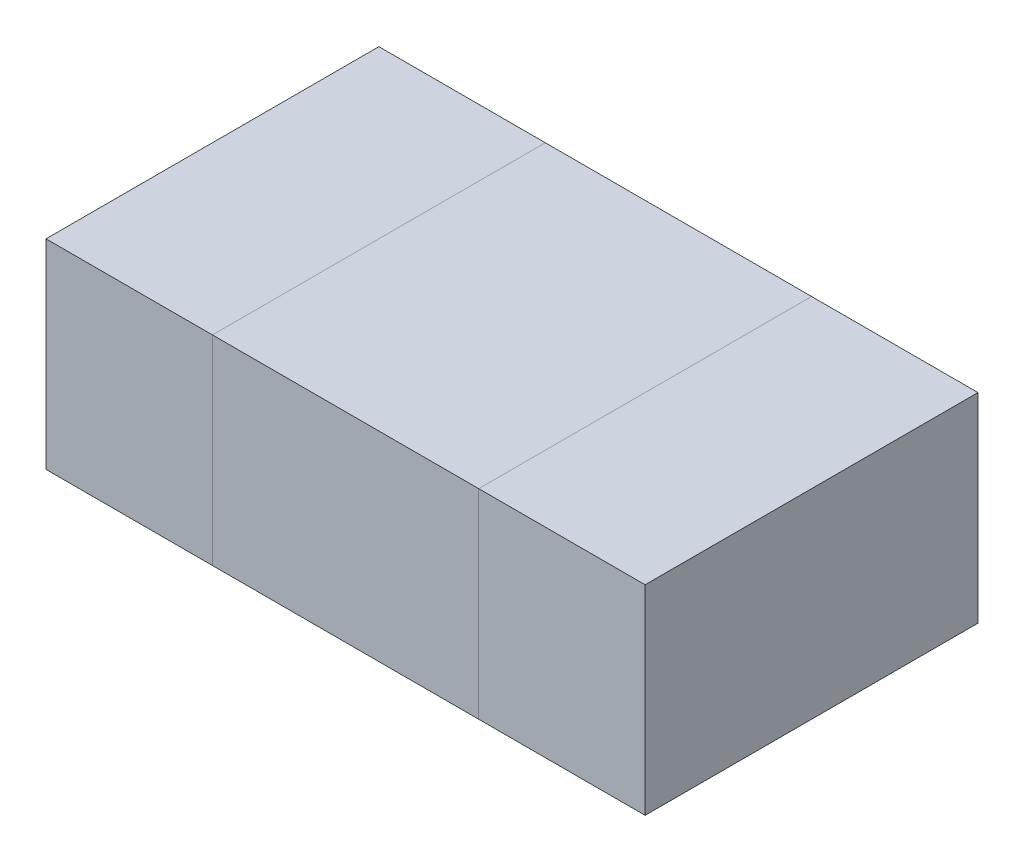
ISO-10303-21;
HEADER;
FILE_DESCRIPTION(('STEP AP214'),'2;1');
FILE_NAME('part.step','',(''),(''),'','','');
FILE_SCHEMA(('AUTOMOTIVE_DESIGN { 1 0 10303 214 1 1 1 1 }'));
ENDSEC;
DATA;
#1=APPLICATION_CONTEXT('core data for automotive mechanical design processes');
#2=APPLICATION_PROTOCOL_DEFINITION('international standard','automotive_design',2000,#1);
#3=PRODUCT_CONTEXT('',#1,'mechanical');
#4=PRODUCT('Part','Part','',(#3));
#5=PRODUCT_RELATED_PRODUCT_CATEGORY('part','',(#4));
#6=PRODUCT_DEFINITION_FORMATION('','',#4);
#7=PRODUCT_DEFINITION_CONTEXT('part definition',#1,'design');
#8=PRODUCT_DEFINITION('design','',#6,#7);
#9=PRODUCT_DEFINITION_SHAPE('','',#8);
#10=(LENGTH_UNIT() NAMED_UNIT(*) SI_UNIT(.MILLI.,.METRE.));
#11=(NAMED_UNIT(*) PLANE_ANGLE_UNIT() SI_UNIT($,.RADIAN.));
#12=(NAMED_UNIT(*) SI_UNIT($,.STERADIAN.) SOLID_ANGLE_UNIT());
#13=UNCERTAINTY_MEASURE_WITH_UNIT(LENGTH_MEASURE(1.E-05),#10,'distance_accuracy_value','');
#14=(GEOMETRIC_REPRESENTATION_CONTEXT(3) GLOBAL_UNCERTAINTY_ASSIGNED_CONTEXT((#13)) GLOBAL_UNIT_ASSIGNED_CONTEXT((#10,
#11,#12)) REPRESENTATION_CONTEXT('',''));
#15=CARTESIAN_POINT('',(0.,0.,0.));
#16=DIRECTION('',(0.,0.,1.));
#17=DIRECTION('',(1.,0.,0.));
#18=AXIS2_PLACEMENT_3D('',#15,#16,#17);
#19=CARTESIAN_POINT('',(0.2,0.3,-0.25));
#20=DIRECTION('',(1.,0.,0.));
#21=DIRECTION('',(0.,0.,-1.));
#22=AXIS2_PLACEMENT_3D('',#19,#20,#21);
#23=PLANE('',#22);
#24=DIRECTION('',(0.,0.,1.));
#25=VECTOR('',#24,1.);
#26=CARTESIAN_POINT('',(0.2,0.,-0.25));
#27=LINE('',#26,#25);
#28=CARTESIAN_POINT('',(0.2,0.,-0.25));
#29=VERTEX_POINT('',#28);
#30=CARTESIAN_POINT('',(0.2,0.,0.25));
#31=VERTEX_POINT('',#30);
#32=EDGE_CURVE('E117',#29,#31,#27,.T.);
#33=ORIENTED_EDGE('',*,*,#32,.T.);
#34=DIRECTION('',(0.,-1.,0.));
#35=VECTOR('',#34,1.);
#36=CARTESIAN_POINT('',(0.2,0.3,0.25));
#37=LINE('',#36,#35);
#38=CARTESIAN_POINT('',(0.2,0.3,0.25));
#39=VERTEX_POINT('',#38);
#40=EDGE_CURVE('E12',#39,#31,#37,.T.);
#41=ORIENTED_EDGE('',*,*,#40,.F.);
#42=DIRECTION('',(0.,0.,1.));
#43=VECTOR('',#42,1.);
#44=CARTESIAN_POINT('',(0.2,0.3,-0.25));
#45=LINE('',#44,#43);
#46=CARTESIAN_POINT('',(0.2,0.3,-0.25));
#47=VERTEX_POINT('',#46);
#48=EDGE_CURVE('E100',#47,#39,#45,.T.);
#49=ORIENTED_EDGE('',*,*,#48,.F.);
#50=DIRECTION('',(0.,-1.,0.));
#51=VECTOR('',#50,1.);
#52=CARTESIAN_POINT('',(0.2,0.3,-0.25));
#53=LINE('',#52,#51);
#54=EDGE_CURVE('E113',#47,#29,#53,.T.);
#55=ORIENTED_EDGE('',*,*,#54,.T.);
#56=EDGE_LOOP('',(#33,#41,#49,#55));
#57=FACE_BOUND('',#56,.T.);
#58=ADVANCED_FACE('F48',(#57),#23,.F.);
#59=CARTESIAN_POINT('',(0.2,0.3,0.25));
#60=DIRECTION('',(0.,0.,-1.));
#61=DIRECTION('',(-1.,0.,0.));
#62=AXIS2_PLACEMENT_3D('',#59,#60,#61);
#63=PLANE('',#62);
#64=DIRECTION('',(1.,0.,0.));
#65=VECTOR('',#64,1.);
#66=CARTESIAN_POINT('',(0.2,0.,0.25));
#67=LINE('',#66,#65);
#68=CARTESIAN_POINT('',(0.45,0.,0.25));
#69=VERTEX_POINT('',#68);
#70=EDGE_CURVE('E105',#31,#69,#67,.T.);
#71=ORIENTED_EDGE('',*,*,#70,.T.);
#72=DIRECTION('',(0.,-1.,0.));
#73=VECTOR('',#72,1.);
#74=CARTESIAN_POINT('',(0.45,0.3,0.25));
#75=LINE('',#74,#73);
#76=CARTESIAN_POINT('',(0.45,0.3,0.25));
#77=VERTEX_POINT('',#76);
#78=EDGE_CURVE('E57',#77,#69,#75,.T.);
#79=ORIENTED_EDGE('',*,*,#78,.F.);
#80=DIRECTION('',(1.,0.,0.));
#81=VECTOR('',#80,1.);
#82=CARTESIAN_POINT('',(0.2,0.3,0.25));
#83=LINE('',#82,#81);
#84=EDGE_CURVE('E95',#39,#77,#83,.T.);
#85=ORIENTED_EDGE('',*,*,#84,.F.);
#86=ORIENTED_EDGE('',*,*,#40,.T.);
#87=EDGE_LOOP('',(#71,#79,#85,#86));
#88=FACE_BOUND('',#87,.T.);
#89=ADVANCED_FACE('F104',(#88),#63,.F.);
#90=CARTESIAN_POINT('',(0.45,0.3,-0.25));
#91=DIRECTION('',(-1.,0.,0.));
#92=DIRECTION('',(0.,0.,1.));
#93=AXIS2_PLACEMENT_3D('',#90,#91,#92);
#94=PLANE('',#93);
#95=DIRECTION('',(0.,0.,-1.));
#96=VECTOR('',#95,1.);
#97=CARTESIAN_POINT('',(0.45,0.,-0.25));
#98=LINE('',#97,#96);
#99=CARTESIAN_POINT('',(0.45,0.,-0.25));
#100=VERTEX_POINT('',#99);
#101=EDGE_CURVE('E82',#69,#100,#98,.T.);
#102=ORIENTED_EDGE('',*,*,#101,.T.);
#103=DIRECTION('',(0.,-1.,0.));
#104=VECTOR('',#103,1.);
#105=CARTESIAN_POINT('',(0.45,0.3,-0.25));
#106=LINE('',#105,#104);
#107=CARTESIAN_POINT('',(0.45,0.3,-0.25));
#108=VERTEX_POINT('',#107);
#109=EDGE_CURVE('E107',#108,#100,#106,.T.);
#110=ORIENTED_EDGE('',*,*,#109,.F.);
#111=DIRECTION('',(0.,0.,-1.));
#112=VECTOR('',#111,1.);
#113=CARTESIAN_POINT('',(0.45,0.3,-0.25));
#114=LINE('',#113,#112);
#115=EDGE_CURVE('E98',#77,#108,#114,.T.);
#116=ORIENTED_EDGE('',*,*,#115,.F.);
#117=ORIENTED_EDGE('',*,*,#78,.T.);
#118=EDGE_LOOP('',(#102,#110,#116,#117));
#119=FACE_BOUND('',#118,.T.);
#120=ADVANCED_FACE('F108',(#119),#94,.F.);
#121=CARTESIAN_POINT('',(0.2,0.3,-0.25));
#122=DIRECTION('',(0.,0.,1.));
#123=DIRECTION('',(1.,0.,0.));
#124=AXIS2_PLACEMENT_3D('',#121,#122,#123);
#125=PLANE('',#124);
#126=DIRECTION('',(-1.,0.,0.));
#127=VECTOR('',#126,1.);
#128=CARTESIAN_POINT('',(0.2,0.,-0.25));
#129=LINE('',#128,#127);
#130=EDGE_CURVE('E88',#100,#29,#129,.T.);
#131=ORIENTED_EDGE('',*,*,#130,.T.);
#132=ORIENTED_EDGE('',*,*,#54,.F.);
#133=DIRECTION('',(-1.,0.,0.));
#134=VECTOR('',#133,1.);
#135=CARTESIAN_POINT('',(0.2,0.3,-0.25));
#136=LINE('',#135,#134);
#137=EDGE_CURVE('E65',#108,#47,#136,.T.);
#138=ORIENTED_EDGE('',*,*,#137,.F.);
#139=ORIENTED_EDGE('',*,*,#109,.T.);
#140=EDGE_LOOP('',(#131,#132,#138,#139));
#141=FACE_BOUND('',#140,.T.);
#142=ADVANCED_FACE('F130',(#141),#125,.F.);
#143=CARTESIAN_POINT('',(0.,0.3,0.));
#144=DIRECTION('',(0.,1.,0.));
#145=DIRECTION('',(0.,0.,1.));
#146=AXIS2_PLACEMENT_3D('',#143,#144,#145);
#147=PLANE('',#146);
#148=ORIENTED_EDGE('',*,*,#48,.T.);
#149=ORIENTED_EDGE('',*,*,#84,.T.);
#150=ORIENTED_EDGE('',*,*,#115,.T.);
#151=ORIENTED_EDGE('',*,*,#137,.T.);
#152=EDGE_LOOP('',(#148,#149,#150,#151));
#153=FACE_BOUND('',#152,.T.);
#154=ADVANCED_FACE('F96',(#153),#147,.T.);
#155=CARTESIAN_POINT('',(0.,0.,0.));
#156=DIRECTION('',(0.,1.,0.));
#157=DIRECTION('',(0.,0.,1.));
#158=AXIS2_PLACEMENT_3D('',#155,#156,#157);
#159=PLANE('',#158);
#160=ORIENTED_EDGE('',*,*,#32,.F.);
#161=ORIENTED_EDGE('',*,*,#130,.F.);
#162=ORIENTED_EDGE('',*,*,#101,.F.);
#163=ORIENTED_EDGE('',*,*,#70,.F.);
#164=EDGE_LOOP('',(#160,#161,#162,#163));
#165=FACE_BOUND('',#164,.T.);
#166=ADVANCED_FACE('F133',(#165),#159,.F.);
#167=CLOSED_SHELL('',(#58,#89,#120,#142,#154,#166));
#168=MANIFOLD_SOLID_BREP('B2',#167);
#169=CARTESIAN_POINT('',(-0.2,0.3,-0.25));
#170=DIRECTION('',(-1.,0.,0.));
#171=DIRECTION('',(0.,0.,1.));
#172=AXIS2_PLACEMENT_3D('',#169,#170,#171);
#173=PLANE('',#172);
#174=DIRECTION('',(0.,0.,-1.));
#175=VECTOR('',#174,1.);
#176=CARTESIAN_POINT('',(-0.2,0.,-0.25));
#177=LINE('',#176,#175);
#178=CARTESIAN_POINT('',(-0.2,0.,0.25));
#179=VERTEX_POINT('',#178);
#180=CARTESIAN_POINT('',(-0.2,0.,-0.25));
#181=VERTEX_POINT('',#180);
#182=EDGE_CURVE('E268',#179,#181,#177,.T.);
#183=ORIENTED_EDGE('',*,*,#182,.T.);
#184=DIRECTION('',(0.,-1.,0.));
#185=VECTOR('',#184,1.);
#186=CARTESIAN_POINT('',(-0.2,0.3,-0.25));
#187=LINE('',#186,#185);
#188=CARTESIAN_POINT('',(-0.2,0.3,-0.25));
#189=VERTEX_POINT('',#188);
#190=EDGE_CURVE('E46',#189,#181,#187,.T.);
#191=ORIENTED_EDGE('',*,*,#190,.F.);
#192=DIRECTION('',(0.,0.,-1.));
#193=VECTOR('',#192,1.);
#194=CARTESIAN_POINT('',(-0.2,0.3,-0.25));
#195=LINE('',#194,#193);
#196=CARTESIAN_POINT('',(-0.2,0.3,0.25));
#197=VERTEX_POINT('',#196);
#198=EDGE_CURVE('E251',#197,#189,#195,.T.);
#199=ORIENTED_EDGE('',*,*,#198,.F.);
#200=DIRECTION('',(0.,-1.,0.));
#201=VECTOR('',#200,1.);
#202=CARTESIAN_POINT('',(-0.2,0.3,0.25));
#203=LINE('',#202,#201);
#204=EDGE_CURVE('E264',#197,#179,#203,.T.);
#205=ORIENTED_EDGE('',*,*,#204,.T.);
#206=EDGE_LOOP('',(#183,#191,#199,#205));
#207=FACE_BOUND('',#206,.T.);
#208=ADVANCED_FACE('F199',(#207),#173,.F.);
#209=CARTESIAN_POINT('',(-0.2,0.3,-0.25));
#210=DIRECTION('',(0.,0.,1.));
#211=DIRECTION('',(1.,0.,0.));
#212=AXIS2_PLACEMENT_3D('',#209,#210,#211);
#213=PLANE('',#212);
#214=DIRECTION('',(-1.,0.,0.));
#215=VECTOR('',#214,1.);
#216=CARTESIAN_POINT('',(-0.2,0.,-0.25));
#217=LINE('',#216,#215);
#218=CARTESIAN_POINT('',(-0.45,0.,-0.25));
#219=VERTEX_POINT('',#218);
#220=EDGE_CURVE('E256',#181,#219,#217,.T.);
#221=ORIENTED_EDGE('',*,*,#220,.T.);
#222=DIRECTION('',(0.,-1.,0.));
#223=VECTOR('',#222,1.);
#224=CARTESIAN_POINT('',(-0.45,0.3,-0.25));
#225=LINE('',#224,#223);
#226=CARTESIAN_POINT('',(-0.45,0.3,-0.25));
#227=VERTEX_POINT('',#226);
#228=EDGE_CURVE('E208',#227,#219,#225,.T.);
#229=ORIENTED_EDGE('',*,*,#228,.F.);
#230=DIRECTION('',(-1.,0.,0.));
#231=VECTOR('',#230,1.);
#232=CARTESIAN_POINT('',(-0.2,0.3,-0.25));
#233=LINE('',#232,#231);
#234=EDGE_CURVE('E246',#189,#227,#233,.T.);
#235=ORIENTED_EDGE('',*,*,#234,.F.);
#236=ORIENTED_EDGE('',*,*,#190,.T.);
#237=EDGE_LOOP('',(#221,#229,#235,#236));
#238=FACE_BOUND('',#237,.T.);
#239=ADVANCED_FACE('F255',(#238),#213,.F.);
#240=CARTESIAN_POINT('',(-0.45,0.3,-0.25));
#241=DIRECTION('',(1.,0.,0.));
#242=DIRECTION('',(0.,0.,-1.));
#243=AXIS2_PLACEMENT_3D('',#240,#241,#242);
#244=PLANE('',#243);
#245=DIRECTION('',(0.,0.,1.));
#246=VECTOR('',#245,1.);
#247=CARTESIAN_POINT('',(-0.45,0.,-0.25));
#248=LINE('',#247,#246);
#249=CARTESIAN_POINT('',(-0.45,0.,0.25));
#250=VERTEX_POINT('',#249);
#251=EDGE_CURVE('E233',#219,#250,#248,.T.);
#252=ORIENTED_EDGE('',*,*,#251,.T.);
#253=DIRECTION('',(0.,-1.,0.));
#254=VECTOR('',#253,1.);
#255=CARTESIAN_POINT('',(-0.45,0.3,0.25));
#256=LINE('',#255,#254);
#257=CARTESIAN_POINT('',(-0.45,0.3,0.25));
#258=VERTEX_POINT('',#257);
#259=EDGE_CURVE('E258',#258,#250,#256,.T.);
#260=ORIENTED_EDGE('',*,*,#259,.F.);
#261=DIRECTION('',(0.,0.,1.));
#262=VECTOR('',#261,1.);
#263=CARTESIAN_POINT('',(-0.45,0.3,-0.25));
#264=LINE('',#263,#262);
#265=EDGE_CURVE('E249',#227,#258,#264,.T.);
#266=ORIENTED_EDGE('',*,*,#265,.F.);
#267=ORIENTED_EDGE('',*,*,#228,.T.);
#268=EDGE_LOOP('',(#252,#260,#266,#267));
#269=FACE_BOUND('',#268,.T.);
#270=ADVANCED_FACE('F259',(#269),#244,.F.);
#271=CARTESIAN_POINT('',(-0.2,0.3,0.25));
#272=DIRECTION('',(0.,0.,-1.));
#273=DIRECTION('',(-1.,0.,0.));
#274=AXIS2_PLACEMENT_3D('',#271,#272,#273);
#275=PLANE('',#274);
#276=DIRECTION('',(1.,0.,0.));
#277=VECTOR('',#276,1.);
#278=CARTESIAN_POINT('',(-0.2,0.,0.25));
#279=LINE('',#278,#277);
#280=EDGE_CURVE('E239',#250,#179,#279,.T.);
#281=ORIENTED_EDGE('',*,*,#280,.T.);
#282=ORIENTED_EDGE('',*,*,#204,.F.);
#283=DIRECTION('',(1.,0.,0.));
#284=VECTOR('',#283,1.);
#285=CARTESIAN_POINT('',(-0.2,0.3,0.25));
#286=LINE('',#285,#284);
#287=EDGE_CURVE('E216',#258,#197,#286,.T.);
#288=ORIENTED_EDGE('',*,*,#287,.F.);
#289=ORIENTED_EDGE('',*,*,#259,.T.);
#290=EDGE_LOOP('',(#281,#282,#288,#289));
#291=FACE_BOUND('',#290,.T.);
#292=ADVANCED_FACE('F281',(#291),#275,.F.);
#293=CARTESIAN_POINT('',(0.,0.3,0.));
#294=DIRECTION('',(0.,-1.,0.));
#295=DIRECTION('',(0.,0.,-1.));
#296=AXIS2_PLACEMENT_3D('',#293,#294,#295);
#297=PLANE('',#296);
#298=ORIENTED_EDGE('',*,*,#198,.T.);
#299=ORIENTED_EDGE('',*,*,#234,.T.);
#300=ORIENTED_EDGE('',*,*,#265,.T.);
#301=ORIENTED_EDGE('',*,*,#287,.T.);
#302=EDGE_LOOP('',(#298,#299,#300,#301));
#303=FACE_BOUND('',#302,.T.);
#304=ADVANCED_FACE('F247',(#303),#297,.F.);
#305=CARTESIAN_POINT('',(0.,0.,0.));
#306=DIRECTION('',(0.,-1.,0.));
#307=DIRECTION('',(0.,0.,-1.));
#308=AXIS2_PLACEMENT_3D('',#305,#306,#307);
#309=PLANE('',#308);
#310=ORIENTED_EDGE('',*,*,#182,.F.);
#311=ORIENTED_EDGE('',*,*,#280,.F.);
#312=ORIENTED_EDGE('',*,*,#251,.F.);
#313=ORIENTED_EDGE('',*,*,#220,.F.);
#314=EDGE_LOOP('',(#310,#311,#312,#313));
#315=FACE_BOUND('',#314,.T.);
#316=ADVANCED_FACE('F284',(#315),#309,.T.);
#317=CLOSED_SHELL('',(#208,#239,#270,#292,#304,#316));
#318=MANIFOLD_SOLID_BREP('B6',#317);
#319=CARTESIAN_POINT('',(0.2,0.3,0.25));
#320=DIRECTION('',(-1.,0.,0.));
#321=DIRECTION('',(0.,0.,1.));
#322=AXIS2_PLACEMENT_3D('',#319,#320,#321);
#323=PLANE('',#322);
#324=DIRECTION('',(0.,0.,-1.));
#325=VECTOR('',#324,1.);
#326=CARTESIAN_POINT('',(0.2,0.,0.25));
#327=LINE('',#326,#325);
#328=CARTESIAN_POINT('',(0.2,0.,0.25));
#329=VERTEX_POINT('',#328);
#330=CARTESIAN_POINT('',(0.2,0.,-0.25));
#331=VERTEX_POINT('',#330);
#332=EDGE_CURVE('E409',#329,#331,#327,.T.);
#333=ORIENTED_EDGE('',*,*,#332,.T.);
#334=DIRECTION('',(0.,-1.,0.));
#335=VECTOR('',#334,1.);
#336=CARTESIAN_POINT('',(0.2,0.3,-0.25));
#337=LINE('',#336,#335);
#338=CARTESIAN_POINT('',(0.2,0.3,-0.25));
#339=VERTEX_POINT('',#338);
#340=EDGE_CURVE('E197',#339,#331,#337,.T.);
#341=ORIENTED_EDGE('',*,*,#340,.F.);
#342=DIRECTION('',(0.,0.,-1.));
#343=VECTOR('',#342,1.);
#344=CARTESIAN_POINT('',(0.2,0.3,0.25));
#345=LINE('',#344,#343);
#346=CARTESIAN_POINT('',(0.2,0.3,0.25));
#347=VERTEX_POINT('',#346);
#348=EDGE_CURVE('E393',#347,#339,#345,.T.);
#349=ORIENTED_EDGE('',*,*,#348,.F.);
#350=DIRECTION('',(0.,-1.,0.));
#351=VECTOR('',#350,1.);
#352=CARTESIAN_POINT('',(0.2,0.3,0.25));
#353=LINE('',#352,#351);
#354=EDGE_CURVE('E405',#347,#329,#353,.T.);
#355=ORIENTED_EDGE('',*,*,#354,.T.);
#356=EDGE_LOOP('',(#333,#341,#349,#355));
#357=FACE_BOUND('',#356,.T.);
#358=ADVANCED_FACE('F341',(#357),#323,.F.);
#359=CARTESIAN_POINT('',(-0.2,0.3,-0.25));
#360=DIRECTION('',(0.,0.,1.));
#361=DIRECTION('',(1.,0.,0.));
#362=AXIS2_PLACEMENT_3D('',#359,#360,#361);
#363=PLANE('',#362);
#364=DIRECTION('',(-1.,0.,0.));
#365=VECTOR('',#364,1.);
#366=CARTESIAN_POINT('',(-0.2,0.,-0.25));
#367=LINE('',#366,#365);
#368=CARTESIAN_POINT('',(-0.2,0.,-0.25));
#369=VERTEX_POINT('',#368);
#370=EDGE_CURVE('E398',#331,#369,#367,.T.);
#371=ORIENTED_EDGE('',*,*,#370,.T.);
#372=DIRECTION('',(0.,-1.,0.));
#373=VECTOR('',#372,1.);
#374=CARTESIAN_POINT('',(-0.2,0.3,-0.25));
#375=LINE('',#374,#373);
#376=CARTESIAN_POINT('',(-0.2,0.3,-0.25));
#377=VERTEX_POINT('',#376);
#378=EDGE_CURVE('E350',#377,#369,#375,.T.);
#379=ORIENTED_EDGE('',*,*,#378,.F.);
#380=DIRECTION('',(-1.,0.,0.));
#381=VECTOR('',#380,1.);
#382=CARTESIAN_POINT('',(-0.2,0.3,-0.25));
#383=LINE('',#382,#381);
#384=EDGE_CURVE('E388',#339,#377,#383,.T.);
#385=ORIENTED_EDGE('',*,*,#384,.F.);
#386=ORIENTED_EDGE('',*,*,#340,.T.);
#387=EDGE_LOOP('',(#371,#379,#385,#386));
#388=FACE_BOUND('',#387,.T.);
#389=ADVANCED_FACE('F397',(#388),#363,.F.);
#390=CARTESIAN_POINT('',(-0.2,0.3,0.25));
#391=DIRECTION('',(1.,0.,0.));
#392=DIRECTION('',(0.,0.,-1.));
#393=AXIS2_PLACEMENT_3D('',#390,#391,#392);
#394=PLANE('',#393);
#395=DIRECTION('',(0.,0.,1.));
#396=VECTOR('',#395,1.);
#397=CARTESIAN_POINT('',(-0.2,0.,0.25));
#398=LINE('',#397,#396);
#399=CARTESIAN_POINT('',(-0.2,0.,0.25));
#400=VERTEX_POINT('',#399);
#401=EDGE_CURVE('E375',#369,#400,#398,.T.);
#402=ORIENTED_EDGE('',*,*,#401,.T.);
#403=DIRECTION('',(0.,-1.,0.));
#404=VECTOR('',#403,1.);
#405=CARTESIAN_POINT('',(-0.2,0.3,0.25));
#406=LINE('',#405,#404);
#407=CARTESIAN_POINT('',(-0.2,0.3,0.25));
#408=VERTEX_POINT('',#407);
#409=EDGE_CURVE('E400',#408,#400,#406,.T.);
#410=ORIENTED_EDGE('',*,*,#409,.F.);
#411=DIRECTION('',(0.,0.,1.));
#412=VECTOR('',#411,1.);
#413=CARTESIAN_POINT('',(-0.2,0.3,0.25));
#414=LINE('',#413,#412);
#415=EDGE_CURVE('E391',#377,#408,#414,.T.);
#416=ORIENTED_EDGE('',*,*,#415,.F.);
#417=ORIENTED_EDGE('',*,*,#378,.T.);
#418=EDGE_LOOP('',(#402,#410,#416,#417));
#419=FACE_BOUND('',#418,.T.);
#420=ADVANCED_FACE('F401',(#419),#394,.F.);
#421=CARTESIAN_POINT('',(-0.2,0.3,0.25));
#422=DIRECTION('',(0.,0.,-1.));
#423=DIRECTION('',(-1.,0.,0.));
#424=AXIS2_PLACEMENT_3D('',#421,#422,#423);
#425=PLANE('',#424);
#426=DIRECTION('',(1.,0.,0.));
#427=VECTOR('',#426,1.);
#428=CARTESIAN_POINT('',(-0.2,0.,0.25));
#429=LINE('',#428,#427);
#430=EDGE_CURVE('E381',#400,#329,#429,.T.);
#431=ORIENTED_EDGE('',*,*,#430,.T.);
#432=ORIENTED_EDGE('',*,*,#354,.F.);
#433=DIRECTION('',(1.,0.,0.));
#434=VECTOR('',#433,1.);
#435=CARTESIAN_POINT('',(-0.2,0.3,0.25));
#436=LINE('',#435,#434);
#437=EDGE_CURVE('E358',#408,#347,#436,.T.);
#438=ORIENTED_EDGE('',*,*,#437,.F.);
#439=ORIENTED_EDGE('',*,*,#409,.T.);
#440=EDGE_LOOP('',(#431,#432,#438,#439));
#441=FACE_BOUND('',#440,.T.);
#442=ADVANCED_FACE('F422',(#441),#425,.F.);
#443=CARTESIAN_POINT('',(0.,0.3,0.));
#444=DIRECTION('',(0.,-1.,0.));
#445=DIRECTION('',(0.,0.,-1.));
#446=AXIS2_PLACEMENT_3D('',#443,#444,#445);
#447=PLANE('',#446);
#448=ORIENTED_EDGE('',*,*,#348,.T.);
#449=ORIENTED_EDGE('',*,*,#384,.T.);
#450=ORIENTED_EDGE('',*,*,#415,.T.);
#451=ORIENTED_EDGE('',*,*,#437,.T.);
#452=EDGE_LOOP('',(#448,#449,#450,#451));
#453=FACE_BOUND('',#452,.T.);
#454=ADVANCED_FACE('F389',(#453),#447,.F.);
#455=CARTESIAN_POINT('',(0.,0.,0.));
#456=DIRECTION('',(0.,-1.,0.));
#457=DIRECTION('',(0.,0.,-1.));
#458=AXIS2_PLACEMENT_3D('',#455,#456,#457);
#459=PLANE('',#458);
#460=ORIENTED_EDGE('',*,*,#332,.F.);
#461=ORIENTED_EDGE('',*,*,#430,.F.);
#462=ORIENTED_EDGE('',*,*,#401,.F.);
#463=ORIENTED_EDGE('',*,*,#370,.F.);
#464=EDGE_LOOP('',(#460,#461,#462,#463));
#465=FACE_BOUND('',#464,.T.);
#466=ADVANCED_FACE('F425',(#465),#459,.T.);
#467=CLOSED_SHELL('',(#358,#389,#420,#442,#454,#466));
#468=MANIFOLD_SOLID_BREP('B40',#467);
#469=ADVANCED_BREP_SHAPE_REPRESENTATION('',(#18,#168,#318,#468),#14);
#470=SHAPE_DEFINITION_REPRESENTATION(#9,#469);
ENDSEC;
END-ISO-10303-21;
